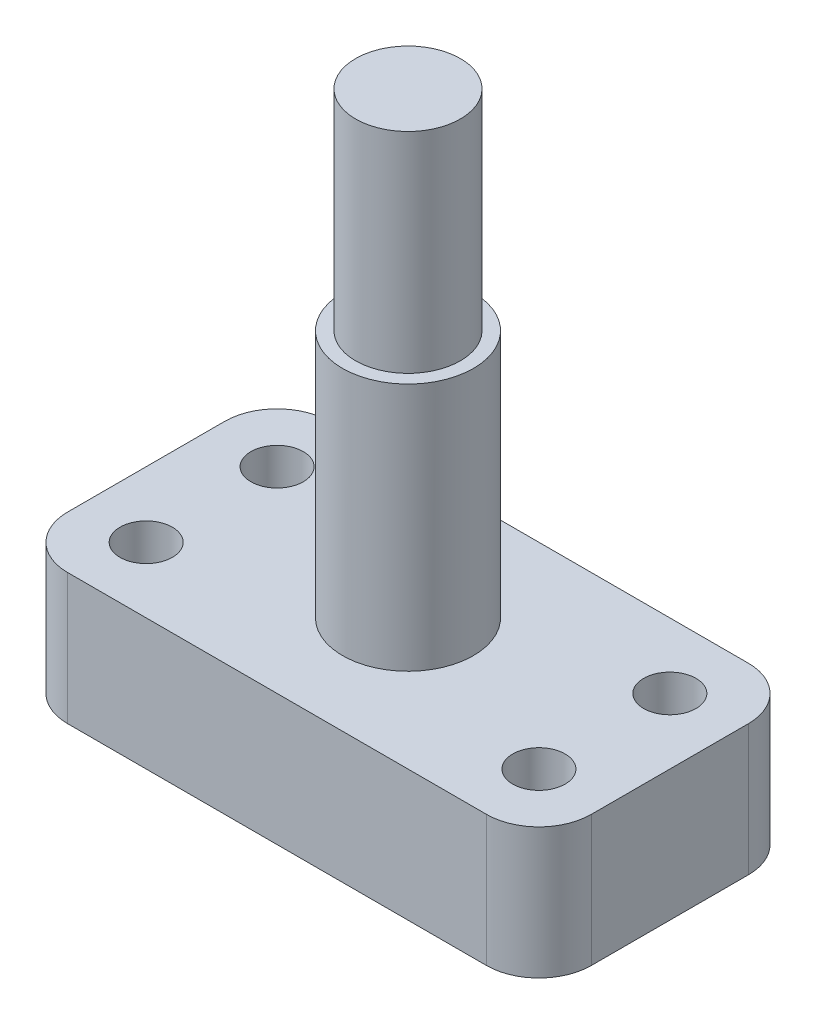
ISO-10303-21;
HEADER;
FILE_DESCRIPTION(('STEP AP214'),'2;1');
FILE_NAME('part.step','',(''),(''),'','','');
FILE_SCHEMA(('AUTOMOTIVE_DESIGN { 1 0 10303 214 1 1 1 1 }'));
ENDSEC;
DATA;
#1=APPLICATION_CONTEXT('core data for automotive mechanical design processes');
#2=APPLICATION_PROTOCOL_DEFINITION('international standard','automotive_design',2000,#1);
#3=PRODUCT_CONTEXT('',#1,'mechanical');
#4=PRODUCT('Part','Part','',(#3));
#5=PRODUCT_RELATED_PRODUCT_CATEGORY('part','',(#4));
#6=PRODUCT_DEFINITION_FORMATION('','',#4);
#7=PRODUCT_DEFINITION_CONTEXT('part definition',#1,'design');
#8=PRODUCT_DEFINITION('design','',#6,#7);
#9=PRODUCT_DEFINITION_SHAPE('','',#8);
#10=(LENGTH_UNIT() NAMED_UNIT(*) SI_UNIT(.MILLI.,.METRE.));
#11=(NAMED_UNIT(*) PLANE_ANGLE_UNIT() SI_UNIT($,.RADIAN.));
#12=(NAMED_UNIT(*) SI_UNIT($,.STERADIAN.) SOLID_ANGLE_UNIT());
#13=UNCERTAINTY_MEASURE_WITH_UNIT(LENGTH_MEASURE(1.E-05),#10,'distance_accuracy_value','');
#14=(GEOMETRIC_REPRESENTATION_CONTEXT(3) GLOBAL_UNCERTAINTY_ASSIGNED_CONTEXT((#13)) GLOBAL_UNIT_ASSIGNED_CONTEXT((#10,
#11,#12)) REPRESENTATION_CONTEXT('',''));
#15=CARTESIAN_POINT('',(0.,0.,0.));
#16=DIRECTION('',(0.,0.,1.));
#17=DIRECTION('',(1.,0.,0.));
#18=AXIS2_PLACEMENT_3D('',#15,#16,#17);
#19=CARTESIAN_POINT('',(20.,29.,-10.));
#20=DIRECTION('',(0.,1.,0.));
#21=DIRECTION('',(0.,0.,1.));
#22=AXIS2_PLACEMENT_3D('',#19,#20,#21);
#23=PLANE('',#22);
#24=CARTESIAN_POINT('',(20.,29.,-10.));
#25=DIRECTION('',(0.,1.,0.));
#26=DIRECTION('',(0.,0.,1.));
#27=AXIS2_PLACEMENT_3D('',#24,#25,#26);
#28=CIRCLE('',#27,5.);
#29=CARTESIAN_POINT('',(20.,29.,-5.));
#30=VERTEX_POINT('',#29);
#31=EDGE_CURVE('E206',#30,#30,#28,.T.);
#32=ORIENTED_EDGE('',*,*,#31,.T.);
#33=EDGE_LOOP('',(#32));
#34=FACE_BOUND('',#33,.T.);
#35=CARTESIAN_POINT('',(20.,29.,-10.));
#36=DIRECTION('',(0.,1.,0.));
#37=DIRECTION('',(0.,0.,1.));
#38=AXIS2_PLACEMENT_3D('',#35,#36,#37);
#39=CIRCLE('',#38,4.);
#40=CARTESIAN_POINT('',(20.,29.,-6.));
#41=VERTEX_POINT('',#40);
#42=EDGE_CURVE('E212',#41,#41,#39,.T.);
#43=ORIENTED_EDGE('',*,*,#42,.F.);
#44=EDGE_LOOP('',(#43));
#45=FACE_BOUND('',#44,.T.);
#46=ADVANCED_FACE('F33',(#34,#45),#23,.T.);
#47=CARTESIAN_POINT('',(36.,10.,-16.));
#48=DIRECTION('',(0.,-1.,0.));
#49=DIRECTION('',(0.,0.,-1.));
#50=AXIS2_PLACEMENT_3D('',#47,#48,#49);
#51=PLANE('',#50);
#52=CARTESIAN_POINT('',(35.,10.,-15.));
#53=DIRECTION('',(0.,1.,0.));
#54=DIRECTION('',(0.,0.,-1.));
#55=AXIS2_PLACEMENT_3D('',#52,#53,#54);
#56=CIRCLE('',#55,2.);
#57=CARTESIAN_POINT('',(35.,10.,-17.));
#58=VERTEX_POINT('',#57);
#59=EDGE_CURVE('E200',#58,#58,#56,.T.);
#60=ORIENTED_EDGE('',*,*,#59,.F.);
#61=EDGE_LOOP('',(#60));
#62=FACE_BOUND('',#61,.T.);
#63=CARTESIAN_POINT('',(5.,10.,-5.));
#64=DIRECTION('',(0.,1.,0.));
#65=DIRECTION('',(0.,0.,-1.));
#66=AXIS2_PLACEMENT_3D('',#63,#64,#65);
#67=CIRCLE('',#66,2.);
#68=CARTESIAN_POINT('',(5.,10.,-7.));
#69=VERTEX_POINT('',#68);
#70=EDGE_CURVE('E188',#69,#69,#67,.T.);
#71=ORIENTED_EDGE('',*,*,#70,.F.);
#72=EDGE_LOOP('',(#71));
#73=FACE_BOUND('',#72,.T.);
#74=CARTESIAN_POINT('',(36.,10.,-16.));
#75=DIRECTION('',(0.,1.,0.));
#76=DIRECTION('',(0.,0.,-1.));
#77=AXIS2_PLACEMENT_3D('',#74,#75,#76);
#78=CIRCLE('',#77,4.);
#79=CARTESIAN_POINT('',(40.,10.,-16.));
#80=VERTEX_POINT('',#79);
#81=CARTESIAN_POINT('',(36.,10.,-20.));
#82=VERTEX_POINT('',#81);
#83=EDGE_CURVE('E147',#80,#82,#78,.T.);
#84=ORIENTED_EDGE('',*,*,#83,.T.);
#85=DIRECTION('',(-1.,0.,0.));
#86=VECTOR('',#85,1.);
#87=CARTESIAN_POINT('',(4.00000000000003,10.,-20.));
#88=LINE('',#87,#86);
#89=CARTESIAN_POINT('',(4.00000000000003,10.,-20.));
#90=VERTEX_POINT('',#89);
#91=EDGE_CURVE('E94',#82,#90,#88,.T.);
#92=ORIENTED_EDGE('',*,*,#91,.T.);
#93=CARTESIAN_POINT('',(4.,10.,-16.));
#94=DIRECTION('',(0.,1.,0.));
#95=DIRECTION('',(0.,0.,-1.));
#96=AXIS2_PLACEMENT_3D('',#93,#94,#95);
#97=CIRCLE('',#96,4.);
#98=CARTESIAN_POINT('',(0.,10.,-16.));
#99=VERTEX_POINT('',#98);
#100=EDGE_CURVE('E179',#90,#99,#97,.T.);
#101=ORIENTED_EDGE('',*,*,#100,.T.);
#102=DIRECTION('',(0.,0.,1.));
#103=VECTOR('',#102,1.);
#104=CARTESIAN_POINT('',(0.,10.,-4.00000000000003));
#105=LINE('',#104,#103);
#106=CARTESIAN_POINT('',(0.,10.,-4.00000000000003));
#107=VERTEX_POINT('',#106);
#108=EDGE_CURVE('E178',#99,#107,#105,.T.);
#109=ORIENTED_EDGE('',*,*,#108,.T.);
#110=CARTESIAN_POINT('',(4.,10.,-4.));
#111=DIRECTION('',(0.,1.,0.));
#112=DIRECTION('',(0.,0.,-1.));
#113=AXIS2_PLACEMENT_3D('',#110,#111,#112);
#114=CIRCLE('',#113,4.);
#115=CARTESIAN_POINT('',(4.00000000000003,10.,0.));
#116=VERTEX_POINT('',#115);
#117=EDGE_CURVE('E114',#107,#116,#114,.T.);
#118=ORIENTED_EDGE('',*,*,#117,.T.);
#119=DIRECTION('',(1.,0.,0.));
#120=VECTOR('',#119,1.);
#121=CARTESIAN_POINT('',(4.00000000000003,10.,0.));
#122=LINE('',#121,#120);
#123=CARTESIAN_POINT('',(36.,10.,0.));
#124=VERTEX_POINT('',#123);
#125=EDGE_CURVE('E107',#116,#124,#122,.T.);
#126=ORIENTED_EDGE('',*,*,#125,.T.);
#127=CARTESIAN_POINT('',(36.,10.,-4.));
#128=DIRECTION('',(0.,1.,0.));
#129=DIRECTION('',(0.,0.,1.));
#130=AXIS2_PLACEMENT_3D('',#127,#128,#129);
#131=CIRCLE('',#130,4.);
#132=CARTESIAN_POINT('',(40.,10.,-4.00000000000003));
#133=VERTEX_POINT('',#132);
#134=EDGE_CURVE('E112',#124,#133,#131,.T.);
#135=ORIENTED_EDGE('',*,*,#134,.T.);
#136=DIRECTION('',(0.,0.,-1.));
#137=VECTOR('',#136,1.);
#138=CARTESIAN_POINT('',(40.,10.,-4.00000000000003));
#139=LINE('',#138,#137);
#140=EDGE_CURVE('E50',#133,#80,#139,.T.);
#141=ORIENTED_EDGE('',*,*,#140,.T.);
#142=EDGE_LOOP('',(#84,#92,#101,#109,#118,#126,#135,#141));
#143=FACE_BOUND('',#142,.T.);
#144=CARTESIAN_POINT('',(5.,10.,-15.));
#145=DIRECTION('',(0.,1.,0.));
#146=DIRECTION('',(0.,0.,1.));
#147=AXIS2_PLACEMENT_3D('',#144,#145,#146);
#148=CIRCLE('',#147,2.);
#149=CARTESIAN_POINT('',(5.,10.,-13.));
#150=VERTEX_POINT('',#149);
#151=EDGE_CURVE('E136',#150,#150,#148,.T.);
#152=ORIENTED_EDGE('',*,*,#151,.F.);
#153=EDGE_LOOP('',(#152));
#154=FACE_BOUND('',#153,.T.);
#155=CARTESIAN_POINT('',(35.,10.,-5.));
#156=DIRECTION('',(0.,1.,0.));
#157=DIRECTION('',(0.,0.,1.));
#158=AXIS2_PLACEMENT_3D('',#155,#156,#157);
#159=CIRCLE('',#158,2.);
#160=CARTESIAN_POINT('',(35.,10.,-3.));
#161=VERTEX_POINT('',#160);
#162=EDGE_CURVE('E194',#161,#161,#159,.T.);
#163=ORIENTED_EDGE('',*,*,#162,.F.);
#164=EDGE_LOOP('',(#163));
#165=FACE_BOUND('',#164,.T.);
#166=CARTESIAN_POINT('',(20.,10.,-10.));
#167=DIRECTION('',(0.,-1.,0.));
#168=DIRECTION('',(0.,0.,-1.));
#169=AXIS2_PLACEMENT_3D('',#166,#167,#168);
#170=CIRCLE('',#169,5.);
#171=CARTESIAN_POINT('',(20.,10.,-15.));
#172=VERTEX_POINT('',#171);
#173=EDGE_CURVE('E11',#172,#172,#170,.F.);
#174=ORIENTED_EDGE('',*,*,#173,.F.);
#175=EDGE_LOOP('',(#174));
#176=FACE_BOUND('',#175,.T.);
#177=ADVANCED_FACE('F109',(#62,#73,#143,#154,#165,#176),#51,.F.);
#178=CARTESIAN_POINT('',(36.,0.,-16.));
#179=DIRECTION('',(0.,-1.,0.));
#180=DIRECTION('',(0.,0.,-1.));
#181=AXIS2_PLACEMENT_3D('',#178,#179,#180);
#182=PLANE('',#181);
#183=CARTESIAN_POINT('',(35.,0.,-5.));
#184=DIRECTION('',(0.,1.,0.));
#185=DIRECTION('',(0.,0.,1.));
#186=AXIS2_PLACEMENT_3D('',#183,#184,#185);
#187=CIRCLE('',#186,2.);
#188=CARTESIAN_POINT('',(35.,0.,-3.));
#189=VERTEX_POINT('',#188);
#190=EDGE_CURVE('E197',#189,#189,#187,.T.);
#191=ORIENTED_EDGE('',*,*,#190,.T.);
#192=EDGE_LOOP('',(#191));
#193=FACE_BOUND('',#192,.T.);
#194=CARTESIAN_POINT('',(5.,0.,-15.));
#195=DIRECTION('',(0.,1.,0.));
#196=DIRECTION('',(0.,0.,1.));
#197=AXIS2_PLACEMENT_3D('',#194,#195,#196);
#198=CIRCLE('',#197,2.);
#199=CARTESIAN_POINT('',(5.,0.,-13.));
#200=VERTEX_POINT('',#199);
#201=EDGE_CURVE('E185',#200,#200,#198,.T.);
#202=ORIENTED_EDGE('',*,*,#201,.T.);
#203=EDGE_LOOP('',(#202));
#204=FACE_BOUND('',#203,.T.);
#205=CARTESIAN_POINT('',(36.,0.,-16.));
#206=DIRECTION('',(0.,1.,0.));
#207=DIRECTION('',(0.,0.,-1.));
#208=AXIS2_PLACEMENT_3D('',#205,#206,#207);
#209=CIRCLE('',#208,4.);
#210=CARTESIAN_POINT('',(40.,0.,-16.));
#211=VERTEX_POINT('',#210);
#212=CARTESIAN_POINT('',(36.,0.,-20.));
#213=VERTEX_POINT('',#212);
#214=EDGE_CURVE('E132',#211,#213,#209,.T.);
#215=ORIENTED_EDGE('',*,*,#214,.F.);
#216=DIRECTION('',(0.,0.,-1.));
#217=VECTOR('',#216,1.);
#218=CARTESIAN_POINT('',(40.,0.,-4.00000000000003));
#219=LINE('',#218,#217);
#220=CARTESIAN_POINT('',(40.,0.,-4.00000000000003));
#221=VERTEX_POINT('',#220);
#222=EDGE_CURVE('E85',#221,#211,#219,.T.);
#223=ORIENTED_EDGE('',*,*,#222,.F.);
#224=CARTESIAN_POINT('',(36.,0.,-4.));
#225=DIRECTION('',(0.,1.,0.));
#226=DIRECTION('',(0.,0.,1.));
#227=AXIS2_PLACEMENT_3D('',#224,#225,#226);
#228=CIRCLE('',#227,4.);
#229=CARTESIAN_POINT('',(36.,0.,0.));
#230=VERTEX_POINT('',#229);
#231=EDGE_CURVE('E79',#230,#221,#228,.T.);
#232=ORIENTED_EDGE('',*,*,#231,.F.);
#233=DIRECTION('',(1.,0.,0.));
#234=VECTOR('',#233,1.);
#235=CARTESIAN_POINT('',(4.00000000000003,0.,0.));
#236=LINE('',#235,#234);
#237=CARTESIAN_POINT('',(4.00000000000003,0.,0.));
#238=VERTEX_POINT('',#237);
#239=EDGE_CURVE('E122',#238,#230,#236,.T.);
#240=ORIENTED_EDGE('',*,*,#239,.F.);
#241=CARTESIAN_POINT('',(4.,0.,-4.));
#242=DIRECTION('',(0.,1.,0.));
#243=DIRECTION('',(0.,0.,-1.));
#244=AXIS2_PLACEMENT_3D('',#241,#242,#243);
#245=CIRCLE('',#244,4.);
#246=CARTESIAN_POINT('',(0.,0.,-4.00000000000003));
#247=VERTEX_POINT('',#246);
#248=EDGE_CURVE('E142',#247,#238,#245,.T.);
#249=ORIENTED_EDGE('',*,*,#248,.F.);
#250=DIRECTION('',(0.,0.,1.));
#251=VECTOR('',#250,1.);
#252=CARTESIAN_POINT('',(0.,0.,-4.00000000000003));
#253=LINE('',#252,#251);
#254=CARTESIAN_POINT('',(0.,0.,-16.));
#255=VERTEX_POINT('',#254);
#256=EDGE_CURVE('E140',#255,#247,#253,.T.);
#257=ORIENTED_EDGE('',*,*,#256,.F.);
#258=CARTESIAN_POINT('',(4.,0.,-16.));
#259=DIRECTION('',(0.,1.,0.));
#260=DIRECTION('',(0.,0.,-1.));
#261=AXIS2_PLACEMENT_3D('',#258,#259,#260);
#262=CIRCLE('',#261,4.);
#263=CARTESIAN_POINT('',(4.00000000000003,0.,-20.));
#264=VERTEX_POINT('',#263);
#265=EDGE_CURVE('E138',#264,#255,#262,.T.);
#266=ORIENTED_EDGE('',*,*,#265,.F.);
#267=DIRECTION('',(-1.,0.,0.));
#268=VECTOR('',#267,1.);
#269=CARTESIAN_POINT('',(4.00000000000003,0.,-20.));
#270=LINE('',#269,#268);
#271=EDGE_CURVE('E135',#213,#264,#270,.T.);
#272=ORIENTED_EDGE('',*,*,#271,.F.);
#273=EDGE_LOOP('',(#215,#223,#232,#240,#249,#257,#266,#272));
#274=FACE_BOUND('',#273,.T.);
#275=CARTESIAN_POINT('',(5.,0.,-5.));
#276=DIRECTION('',(0.,1.,0.));
#277=DIRECTION('',(0.,0.,-1.));
#278=AXIS2_PLACEMENT_3D('',#275,#276,#277);
#279=CIRCLE('',#278,2.);
#280=CARTESIAN_POINT('',(5.,0.,-7.));
#281=VERTEX_POINT('',#280);
#282=EDGE_CURVE('E191',#281,#281,#279,.T.);
#283=ORIENTED_EDGE('',*,*,#282,.T.);
#284=EDGE_LOOP('',(#283));
#285=FACE_BOUND('',#284,.T.);
#286=CARTESIAN_POINT('',(35.,0.,-15.));
#287=DIRECTION('',(0.,1.,0.));
#288=DIRECTION('',(0.,0.,-1.));
#289=AXIS2_PLACEMENT_3D('',#286,#287,#288);
#290=CIRCLE('',#289,2.);
#291=CARTESIAN_POINT('',(35.,0.,-17.));
#292=VERTEX_POINT('',#291);
#293=EDGE_CURVE('E203',#292,#292,#290,.T.);
#294=ORIENTED_EDGE('',*,*,#293,.T.);
#295=EDGE_LOOP('',(#294));
#296=FACE_BOUND('',#295,.T.);
#297=ADVANCED_FACE('F165',(#193,#204,#274,#285,#296),#182,.T.);
#298=CARTESIAN_POINT('',(36.,10.,-16.));
#299=DIRECTION('',(0.,-1.,0.));
#300=DIRECTION('',(0.,0.,-1.));
#301=AXIS2_PLACEMENT_3D('',#298,#299,#300);
#302=CYLINDRICAL_SURFACE('',#301,4.);
#303=ORIENTED_EDGE('',*,*,#214,.T.);
#304=DIRECTION('',(0.,-1.,0.));
#305=VECTOR('',#304,1.);
#306=CARTESIAN_POINT('',(36.,10.,-20.));
#307=LINE('',#306,#305);
#308=EDGE_CURVE('E42',#82,#213,#307,.T.);
#309=ORIENTED_EDGE('',*,*,#308,.F.);
#310=ORIENTED_EDGE('',*,*,#83,.F.);
#311=DIRECTION('',(0.,-1.,0.));
#312=VECTOR('',#311,1.);
#313=CARTESIAN_POINT('',(40.,10.,-16.));
#314=LINE('',#313,#312);
#315=EDGE_CURVE('E128',#80,#211,#314,.T.);
#316=ORIENTED_EDGE('',*,*,#315,.T.);
#317=EDGE_LOOP('',(#303,#309,#310,#316));
#318=FACE_BOUND('',#317,.T.);
#319=ADVANCED_FACE('F35',(#318),#302,.T.);
#320=CARTESIAN_POINT('',(4.00000000000003,10.,-20.));
#321=DIRECTION('',(0.,0.,1.));
#322=DIRECTION('',(1.,0.,0.));
#323=AXIS2_PLACEMENT_3D('',#320,#321,#322);
#324=PLANE('',#323);
#325=ORIENTED_EDGE('',*,*,#271,.T.);
#326=DIRECTION('',(0.,-1.,0.));
#327=VECTOR('',#326,1.);
#328=CARTESIAN_POINT('',(4.00000000000003,10.,-20.));
#329=LINE('',#328,#327);
#330=EDGE_CURVE('E157',#90,#264,#329,.T.);
#331=ORIENTED_EDGE('',*,*,#330,.F.);
#332=ORIENTED_EDGE('',*,*,#91,.F.);
#333=ORIENTED_EDGE('',*,*,#308,.T.);
#334=EDGE_LOOP('',(#325,#331,#332,#333));
#335=FACE_BOUND('',#334,.T.);
#336=ADVANCED_FACE('F160',(#335),#324,.F.);
#337=CARTESIAN_POINT('',(4.,10.,-16.));
#338=DIRECTION('',(0.,-1.,0.));
#339=DIRECTION('',(0.,0.,-1.));
#340=AXIS2_PLACEMENT_3D('',#337,#338,#339);
#341=CYLINDRICAL_SURFACE('',#340,4.);
#342=ORIENTED_EDGE('',*,*,#265,.T.);
#343=DIRECTION('',(0.,-1.,0.));
#344=VECTOR('',#343,1.);
#345=CARTESIAN_POINT('',(0.,10.,-16.));
#346=LINE('',#345,#344);
#347=EDGE_CURVE('E154',#99,#255,#346,.T.);
#348=ORIENTED_EDGE('',*,*,#347,.F.);
#349=ORIENTED_EDGE('',*,*,#100,.F.);
#350=ORIENTED_EDGE('',*,*,#330,.T.);
#351=EDGE_LOOP('',(#342,#348,#349,#350));
#352=FACE_BOUND('',#351,.T.);
#353=ADVANCED_FACE('F172',(#352),#341,.T.);
#354=CARTESIAN_POINT('',(0.,10.,-4.00000000000003));
#355=DIRECTION('',(1.,0.,0.));
#356=DIRECTION('',(0.,0.,-1.));
#357=AXIS2_PLACEMENT_3D('',#354,#355,#356);
#358=PLANE('',#357);
#359=ORIENTED_EDGE('',*,*,#256,.T.);
#360=DIRECTION('',(0.,-1.,0.));
#361=VECTOR('',#360,1.);
#362=CARTESIAN_POINT('',(0.,10.,-4.00000000000003));
#363=LINE('',#362,#361);
#364=EDGE_CURVE('E151',#107,#247,#363,.T.);
#365=ORIENTED_EDGE('',*,*,#364,.F.);
#366=ORIENTED_EDGE('',*,*,#108,.F.);
#367=ORIENTED_EDGE('',*,*,#347,.T.);
#368=EDGE_LOOP('',(#359,#365,#366,#367));
#369=FACE_BOUND('',#368,.T.);
#370=ADVANCED_FACE('F176',(#369),#358,.F.);
#371=CARTESIAN_POINT('',(4.,10.,-4.));
#372=DIRECTION('',(0.,-1.,0.));
#373=DIRECTION('',(0.,0.,-1.));
#374=AXIS2_PLACEMENT_3D('',#371,#372,#373);
#375=CYLINDRICAL_SURFACE('',#374,4.);
#376=ORIENTED_EDGE('',*,*,#248,.T.);
#377=DIRECTION('',(0.,-1.,0.));
#378=VECTOR('',#377,1.);
#379=CARTESIAN_POINT('',(4.00000000000003,10.,0.));
#380=LINE('',#379,#378);
#381=EDGE_CURVE('E123',#116,#238,#380,.T.);
#382=ORIENTED_EDGE('',*,*,#381,.F.);
#383=ORIENTED_EDGE('',*,*,#117,.F.);
#384=ORIENTED_EDGE('',*,*,#364,.T.);
#385=EDGE_LOOP('',(#376,#382,#383,#384));
#386=FACE_BOUND('',#385,.T.);
#387=ADVANCED_FACE('F266',(#386),#375,.T.);
#388=CARTESIAN_POINT('',(4.00000000000003,10.,0.));
#389=DIRECTION('',(0.,0.,-1.));
#390=DIRECTION('',(-1.,0.,0.));
#391=AXIS2_PLACEMENT_3D('',#388,#389,#390);
#392=PLANE('',#391);
#393=ORIENTED_EDGE('',*,*,#239,.T.);
#394=DIRECTION('',(0.,-1.,0.));
#395=VECTOR('',#394,1.);
#396=CARTESIAN_POINT('',(36.,10.,0.));
#397=LINE('',#396,#395);
#398=EDGE_CURVE('E119',#124,#230,#397,.T.);
#399=ORIENTED_EDGE('',*,*,#398,.F.);
#400=ORIENTED_EDGE('',*,*,#125,.F.);
#401=ORIENTED_EDGE('',*,*,#381,.T.);
#402=EDGE_LOOP('',(#393,#399,#400,#401));
#403=FACE_BOUND('',#402,.T.);
#404=ADVANCED_FACE('F120',(#403),#392,.F.);
#405=CARTESIAN_POINT('',(36.,10.,-4.));
#406=DIRECTION('',(0.,-1.,0.));
#407=DIRECTION('',(0.,0.,-1.));
#408=AXIS2_PLACEMENT_3D('',#405,#406,#407);
#409=CYLINDRICAL_SURFACE('',#408,4.);
#410=ORIENTED_EDGE('',*,*,#231,.T.);
#411=DIRECTION('',(0.,-1.,0.));
#412=VECTOR('',#411,1.);
#413=CARTESIAN_POINT('',(40.,10.,-4.00000000000003));
#414=LINE('',#413,#412);
#415=EDGE_CURVE('E124',#133,#221,#414,.T.);
#416=ORIENTED_EDGE('',*,*,#415,.F.);
#417=ORIENTED_EDGE('',*,*,#134,.F.);
#418=ORIENTED_EDGE('',*,*,#398,.T.);
#419=EDGE_LOOP('',(#410,#416,#417,#418));
#420=FACE_BOUND('',#419,.T.);
#421=ADVANCED_FACE('F126',(#420),#409,.T.);
#422=CARTESIAN_POINT('',(40.,10.,-4.00000000000003));
#423=DIRECTION('',(-1.,0.,0.));
#424=DIRECTION('',(0.,0.,1.));
#425=AXIS2_PLACEMENT_3D('',#422,#423,#424);
#426=PLANE('',#425);
#427=ORIENTED_EDGE('',*,*,#222,.T.);
#428=ORIENTED_EDGE('',*,*,#315,.F.);
#429=ORIENTED_EDGE('',*,*,#140,.F.);
#430=ORIENTED_EDGE('',*,*,#415,.T.);
#431=EDGE_LOOP('',(#427,#428,#429,#430));
#432=FACE_BOUND('',#431,.T.);
#433=ADVANCED_FACE('F254',(#432),#426,.F.);
#434=CARTESIAN_POINT('',(5.,10.,-15.));
#435=DIRECTION('',(0.,-1.,0.));
#436=DIRECTION('',(0.,0.,-1.));
#437=AXIS2_PLACEMENT_3D('',#434,#435,#436);
#438=CYLINDRICAL_SURFACE('',#437,2.);
#439=ORIENTED_EDGE('',*,*,#151,.T.);
#440=EDGE_LOOP('',(#439));
#441=FACE_BOUND('',#440,.T.);
#442=ORIENTED_EDGE('',*,*,#201,.F.);
#443=EDGE_LOOP('',(#442));
#444=FACE_BOUND('',#443,.T.);
#445=ADVANCED_FACE('F251',(#441,#444),#438,.F.);
#446=CARTESIAN_POINT('',(5.,10.,-5.));
#447=DIRECTION('',(0.,-1.,0.));
#448=DIRECTION('',(0.,0.,-1.));
#449=AXIS2_PLACEMENT_3D('',#446,#447,#448);
#450=CYLINDRICAL_SURFACE('',#449,2.);
#451=ORIENTED_EDGE('',*,*,#70,.T.);
#452=EDGE_LOOP('',(#451));
#453=FACE_BOUND('',#452,.T.);
#454=ORIENTED_EDGE('',*,*,#282,.F.);
#455=EDGE_LOOP('',(#454));
#456=FACE_BOUND('',#455,.T.);
#457=ADVANCED_FACE('F247',(#453,#456),#450,.F.);
#458=CARTESIAN_POINT('',(35.,10.,-5.));
#459=DIRECTION('',(0.,-1.,0.));
#460=DIRECTION('',(0.,0.,-1.));
#461=AXIS2_PLACEMENT_3D('',#458,#459,#460);
#462=CYLINDRICAL_SURFACE('',#461,2.);
#463=ORIENTED_EDGE('',*,*,#162,.T.);
#464=EDGE_LOOP('',(#463));
#465=FACE_BOUND('',#464,.T.);
#466=ORIENTED_EDGE('',*,*,#190,.F.);
#467=EDGE_LOOP('',(#466));
#468=FACE_BOUND('',#467,.T.);
#469=ADVANCED_FACE('F243',(#465,#468),#462,.F.);
#470=CARTESIAN_POINT('',(35.,10.,-15.));
#471=DIRECTION('',(0.,-1.,0.));
#472=DIRECTION('',(0.,0.,-1.));
#473=AXIS2_PLACEMENT_3D('',#470,#471,#472);
#474=CYLINDRICAL_SURFACE('',#473,2.);
#475=ORIENTED_EDGE('',*,*,#59,.T.);
#476=EDGE_LOOP('',(#475));
#477=FACE_BOUND('',#476,.T.);
#478=ORIENTED_EDGE('',*,*,#293,.F.);
#479=EDGE_LOOP('',(#478));
#480=FACE_BOUND('',#479,.T.);
#481=ADVANCED_FACE('F239',(#477,#480),#474,.F.);
#482=CARTESIAN_POINT('',(20.,29.,-10.));
#483=DIRECTION('',(0.,-1.,0.));
#484=DIRECTION('',(0.,0.,-1.));
#485=AXIS2_PLACEMENT_3D('',#482,#483,#484);
#486=CYLINDRICAL_SURFACE('',#485,5.);
#487=ORIENTED_EDGE('',*,*,#31,.F.);
#488=EDGE_LOOP('',(#487));
#489=FACE_BOUND('',#488,.T.);
#490=ORIENTED_EDGE('',*,*,#173,.T.);
#491=EDGE_LOOP('',(#490));
#492=FACE_BOUND('',#491,.T.);
#493=ADVANCED_FACE('F223',(#489,#492),#486,.T.);
#494=CARTESIAN_POINT('',(20.,45.,-10.));
#495=DIRECTION('',(0.,-1.,0.));
#496=DIRECTION('',(0.,0.,-1.));
#497=AXIS2_PLACEMENT_3D('',#494,#495,#496);
#498=CYLINDRICAL_SURFACE('',#497,4.);
#499=CARTESIAN_POINT('',(20.,45.,-10.));
#500=DIRECTION('',(0.,1.,0.));
#501=DIRECTION('',(0.,0.,1.));
#502=AXIS2_PLACEMENT_3D('',#499,#500,#501);
#503=CIRCLE('',#502,4.);
#504=CARTESIAN_POINT('',(20.,45.,-6.));
#505=VERTEX_POINT('',#504);
#506=EDGE_CURVE('E211',#505,#505,#503,.T.);
#507=ORIENTED_EDGE('',*,*,#506,.F.);
#508=EDGE_LOOP('',(#507));
#509=FACE_BOUND('',#508,.T.);
#510=ORIENTED_EDGE('',*,*,#42,.T.);
#511=EDGE_LOOP('',(#510));
#512=FACE_BOUND('',#511,.T.);
#513=ADVANCED_FACE('F220',(#509,#512),#498,.T.);
#514=CARTESIAN_POINT('',(20.,45.,-10.));
#515=DIRECTION('',(0.,1.,0.));
#516=DIRECTION('',(0.,0.,1.));
#517=AXIS2_PLACEMENT_3D('',#514,#515,#516);
#518=PLANE('',#517);
#519=ORIENTED_EDGE('',*,*,#506,.T.);
#520=EDGE_LOOP('',(#519));
#521=FACE_BOUND('',#520,.T.);
#522=ADVANCED_FACE('F218',(#521),#518,.T.);
#523=CLOSED_SHELL('',(#46,#177,#297,#319,#336,#353,#370,#387,#404,#421,#433,#445,#457,#469,#481,
#493,#513,#522));
#524=MANIFOLD_SOLID_BREP('B2',#523);
#525=ADVANCED_BREP_SHAPE_REPRESENTATION('',(#18,#524),#14);
#526=SHAPE_DEFINITION_REPRESENTATION(#9,#525);
ENDSEC;
END-ISO-10303-21;
